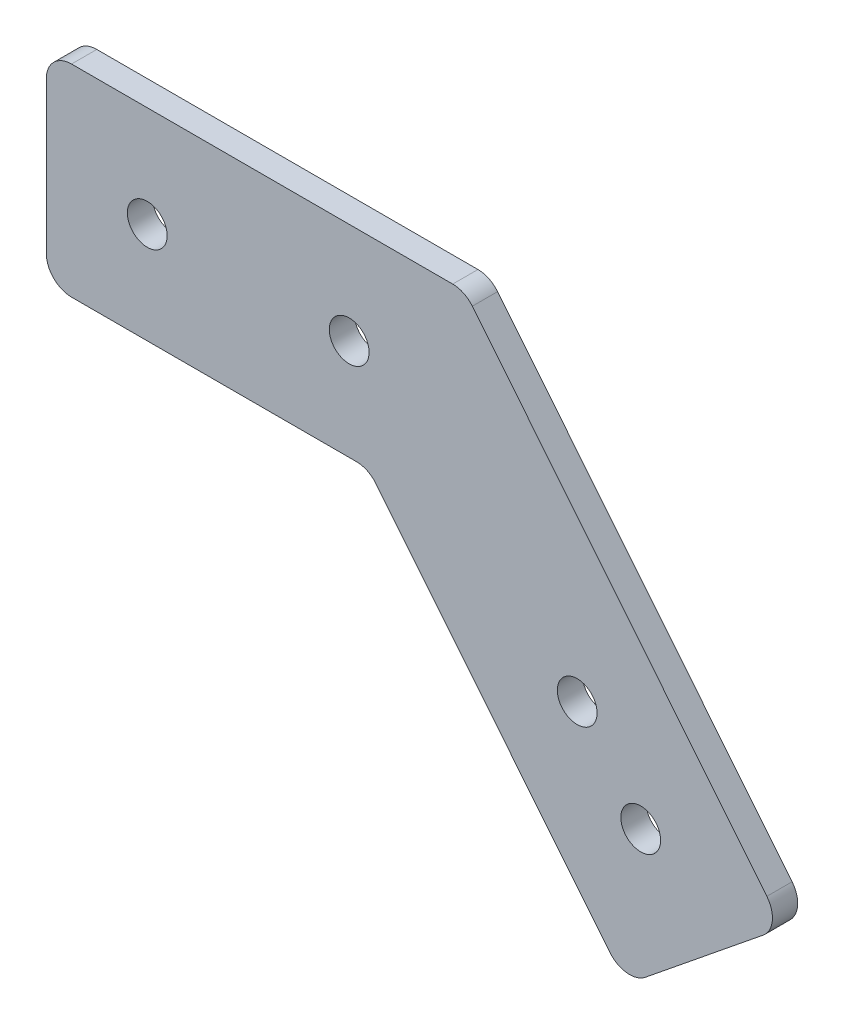
ISO-10303-21;
HEADER;
FILE_DESCRIPTION(('STEP AP214'),'2;1');
FILE_NAME('part.step','',(''),(''),'','','');
FILE_SCHEMA(('AUTOMOTIVE_DESIGN { 1 0 10303 214 1 1 1 1 }'));
ENDSEC;
DATA;
#1=APPLICATION_CONTEXT('core data for automotive mechanical design processes');
#2=APPLICATION_PROTOCOL_DEFINITION('international standard','automotive_design',2000,#1);
#3=PRODUCT_CONTEXT('',#1,'mechanical');
#4=PRODUCT('Part','Part','',(#3));
#5=PRODUCT_RELATED_PRODUCT_CATEGORY('part','',(#4));
#6=PRODUCT_DEFINITION_FORMATION('','',#4);
#7=PRODUCT_DEFINITION_CONTEXT('part definition',#1,'design');
#8=PRODUCT_DEFINITION('design','',#6,#7);
#9=PRODUCT_DEFINITION_SHAPE('','',#8);
#10=(LENGTH_UNIT() NAMED_UNIT(*) SI_UNIT(.MILLI.,.METRE.));
#11=(NAMED_UNIT(*) PLANE_ANGLE_UNIT() SI_UNIT($,.RADIAN.));
#12=(NAMED_UNIT(*) SI_UNIT($,.STERADIAN.) SOLID_ANGLE_UNIT());
#13=UNCERTAINTY_MEASURE_WITH_UNIT(LENGTH_MEASURE(1.E-05),#10,'distance_accuracy_value','');
#14=(GEOMETRIC_REPRESENTATION_CONTEXT(3) GLOBAL_UNCERTAINTY_ASSIGNED_CONTEXT((#13)) GLOBAL_UNIT_ASSIGNED_CONTEXT((#10,
#11,#12)) REPRESENTATION_CONTEXT('',''));
#15=CARTESIAN_POINT('',(0.,0.,0.));
#16=DIRECTION('',(0.,0.,1.));
#17=DIRECTION('',(1.,0.,0.));
#18=AXIS2_PLACEMENT_3D('',#15,#16,#17);
#19=CARTESIAN_POINT('',(0.,734.332068305698,3.175));
#20=DIRECTION('',(0.,1.,0.));
#21=DIRECTION('',(0.,0.,1.));
#22=AXIS2_PLACEMENT_3D('',#19,#20,#21);
#23=PLANE('',#22);
#24=DIRECTION('',(1.,0.,0.));
#25=VECTOR('',#24,1.);
#26=CARTESIAN_POINT('',(0.,734.332068305698,3.175));
#27=LINE('',#26,#25);
#28=CARTESIAN_POINT('',(3.175,734.332068305698,3.175));
#29=VERTEX_POINT('',#28);
#30=CARTESIAN_POINT('',(51.1213444829092,734.332068305698,3.175));
#31=VERTEX_POINT('',#30);
#32=EDGE_CURVE('E206',#29,#31,#27,.T.);
#33=ORIENTED_EDGE('',*,*,#32,.T.);
#34=DIRECTION('',(0.,0.,-1.));
#35=VECTOR('',#34,1.);
#36=CARTESIAN_POINT('',(51.1213444829092,734.332068305698,0.));
#37=LINE('',#36,#35);
#38=CARTESIAN_POINT('',(51.1213444829092,734.332068305698,0.));
#39=VERTEX_POINT('',#38);
#40=EDGE_CURVE('E136',#31,#39,#37,.T.);
#41=ORIENTED_EDGE('',*,*,#40,.T.);
#42=DIRECTION('',(1.,0.,0.));
#43=VECTOR('',#42,1.);
#44=CARTESIAN_POINT('',(0.,734.332068305698,0.));
#45=LINE('',#44,#43);
#46=CARTESIAN_POINT('',(3.175,734.332068305698,0.));
#47=VERTEX_POINT('',#46);
#48=EDGE_CURVE('E203',#47,#39,#45,.T.);
#49=ORIENTED_EDGE('',*,*,#48,.F.);
#50=DIRECTION('',(0.,0.,-1.));
#51=VECTOR('',#50,1.);
#52=CARTESIAN_POINT('',(3.175,734.332068305698,3.175));
#53=LINE('',#52,#51);
#54=EDGE_CURVE('E195',#47,#29,#53,.F.);
#55=ORIENTED_EDGE('',*,*,#54,.T.);
#56=EDGE_LOOP('',(#33,#41,#49,#55));
#57=FACE_BOUND('',#56,.T.);
#58=ADVANCED_FACE('F37',(#57),#23,.T.);
#59=CARTESIAN_POINT('',(1.32199812341468E-13,0.,3.175));
#60=DIRECTION('',(1.,0.,0.));
#61=DIRECTION('',(0.,1.,0.));
#62=AXIS2_PLACEMENT_3D('',#59,#60,#61);
#63=PLANE('',#62);
#64=DIRECTION('',(0.,-1.,0.));
#65=VECTOR('',#64,1.);
#66=CARTESIAN_POINT('',(1.32199812341468E-13,0.,0.));
#67=LINE('',#66,#65);
#68=CARTESIAN_POINT('',(0.,731.157068305698,0.));
#69=VERTEX_POINT('',#68);
#70=CARTESIAN_POINT('',(0.,712.107068305698,0.));
#71=VERTEX_POINT('',#70);
#72=EDGE_CURVE('E145',#69,#71,#67,.T.);
#73=ORIENTED_EDGE('',*,*,#72,.T.);
#74=DIRECTION('',(0.,0.,-1.));
#75=VECTOR('',#74,1.);
#76=CARTESIAN_POINT('',(0.,712.107068305698,3.175));
#77=LINE('',#76,#75);
#78=CARTESIAN_POINT('',(0.,712.107068305698,3.175));
#79=VERTEX_POINT('',#78);
#80=EDGE_CURVE('E171',#71,#79,#77,.F.);
#81=ORIENTED_EDGE('',*,*,#80,.T.);
#82=DIRECTION('',(0.,-1.,0.));
#83=VECTOR('',#82,1.);
#84=CARTESIAN_POINT('',(1.32199812341468E-13,0.,3.175));
#85=LINE('',#84,#83);
#86=CARTESIAN_POINT('',(0.,731.157068305698,3.175));
#87=VERTEX_POINT('',#86);
#88=EDGE_CURVE('E241',#87,#79,#85,.T.);
#89=ORIENTED_EDGE('',*,*,#88,.F.);
#90=DIRECTION('',(0.,0.,-1.));
#91=VECTOR('',#90,1.);
#92=CARTESIAN_POINT('',(0.,731.157068305698,0.));
#93=LINE('',#92,#91);
#94=EDGE_CURVE('E168',#87,#69,#93,.T.);
#95=ORIENTED_EDGE('',*,*,#94,.T.);
#96=EDGE_LOOP('',(#73,#81,#89,#95));
#97=FACE_BOUND('',#96,.T.);
#98=ADVANCED_FACE('F277',(#97),#63,.F.);
#99=CARTESIAN_POINT('',(0.,708.932068305698,3.175));
#100=DIRECTION('',(0.,-1.,0.));
#101=DIRECTION('',(0.,0.,-1.));
#102=AXIS2_PLACEMENT_3D('',#99,#100,#101);
#103=PLANE('',#102);
#104=DIRECTION('',(-1.,0.,0.));
#105=VECTOR('',#104,1.);
#106=CARTESIAN_POINT('',(0.,708.932068305698,3.175));
#107=LINE('',#106,#105);
#108=CARTESIAN_POINT('',(39.0039981510798,708.932068305698,3.175));
#109=VERTEX_POINT('',#108);
#110=CARTESIAN_POINT('',(3.175,708.932068305698,3.175));
#111=VERTEX_POINT('',#110);
#112=EDGE_CURVE('E244',#109,#111,#107,.T.);
#113=ORIENTED_EDGE('',*,*,#112,.T.);
#114=DIRECTION('',(0.,0.,-1.));
#115=VECTOR('',#114,1.);
#116=CARTESIAN_POINT('',(3.175,708.932068305698,0.));
#117=LINE('',#116,#115);
#118=CARTESIAN_POINT('',(3.175,708.932068305698,0.));
#119=VERTEX_POINT('',#118);
#120=EDGE_CURVE('E144',#111,#119,#117,.T.);
#121=ORIENTED_EDGE('',*,*,#120,.T.);
#122=DIRECTION('',(-1.,0.,0.));
#123=VECTOR('',#122,1.);
#124=CARTESIAN_POINT('',(0.,708.932068305698,0.));
#125=LINE('',#124,#123);
#126=CARTESIAN_POINT('',(39.0039981510798,708.932068305698,0.));
#127=VERTEX_POINT('',#126);
#128=EDGE_CURVE('E129',#127,#119,#125,.T.);
#129=ORIENTED_EDGE('',*,*,#128,.F.);
#130=DIRECTION('',(0.,0.,-1.));
#131=VECTOR('',#130,1.);
#132=CARTESIAN_POINT('',(39.0039981510798,708.932068305698,3.175));
#133=LINE('',#132,#131);
#134=EDGE_CURVE('E141',#127,#109,#133,.F.);
#135=ORIENTED_EDGE('',*,*,#134,.T.);
#136=EDGE_LOOP('',(#113,#121,#129,#135));
#137=FACE_BOUND('',#136,.T.);
#138=ADVANCED_FACE('F140',(#137),#103,.T.);
#139=CARTESIAN_POINT('',(371.176588177199,300.487426123172,3.175));
#140=DIRECTION('',(-0.777233462324333,-0.62921232111532,0.));
#141=DIRECTION('',(0.62921232111532,-0.777233462324334,0.));
#142=AXIS2_PLACEMENT_3D('',#139,#140,#141);
#143=PLANE('',#142);
#144=DIRECTION('',(-0.62921232111532,0.777233462324334,0.));
#145=VECTOR('',#144,1.);
#146=CARTESIAN_POINT('',(371.176588177199,300.487426123172,3.175));
#147=LINE('',#146,#145);
#148=CARTESIAN_POINT('',(70.8953718216004,671.409294031492,3.175));
#149=VERTEX_POINT('',#148);
#150=CARTESIAN_POINT('',(41.4717143939596,707.754817425239,3.175));
#151=VERTEX_POINT('',#150);
#152=EDGE_CURVE('E246',#149,#151,#147,.T.);
#153=ORIENTED_EDGE('',*,*,#152,.T.);
#154=DIRECTION('',(0.,0.,-1.));
#155=VECTOR('',#154,1.);
#156=CARTESIAN_POINT('',(41.4717143939596,707.754817425239,0.));
#157=LINE('',#156,#155);
#158=CARTESIAN_POINT('',(41.4717143939596,707.754817425239,0.));
#159=VERTEX_POINT('',#158);
#160=EDGE_CURVE('E184',#151,#159,#157,.T.);
#161=ORIENTED_EDGE('',*,*,#160,.T.);
#162=DIRECTION('',(-0.62921232111532,0.777233462324334,0.));
#163=VECTOR('',#162,1.);
#164=CARTESIAN_POINT('',(371.176588177199,300.487426123172,0.));
#165=LINE('',#164,#163);
#166=CARTESIAN_POINT('',(70.8953718216004,671.409294031492,0.));
#167=VERTEX_POINT('',#166);
#168=EDGE_CURVE('E131',#167,#159,#165,.T.);
#169=ORIENTED_EDGE('',*,*,#168,.F.);
#170=DIRECTION('',(0.,0.,-1.));
#171=VECTOR('',#170,1.);
#172=CARTESIAN_POINT('',(70.8953718216004,671.409294031492,3.175));
#173=LINE('',#172,#171);
#174=EDGE_CURVE('E182',#167,#149,#173,.F.);
#175=ORIENTED_EDGE('',*,*,#174,.T.);
#176=EDGE_LOOP('',(#153,#161,#169,#175));
#177=FACE_BOUND('',#176,.T.);
#178=ADVANCED_FACE('F287',(#177),#143,.T.);
#179=CARTESIAN_POINT('',(-298.283467236057,368.454151665441,3.175));
#180=DIRECTION('',(-0.629212321115319,0.777233462324334,0.));
#181=DIRECTION('',(-0.777233462324334,-0.629212321115319,0.));
#182=AXIS2_PLACEMENT_3D('',#179,#180,#181);
#183=PLANE('',#182);
#184=DIRECTION('',(0.777233462324334,0.629212321115319,0.));
#185=VECTOR('',#184,1.);
#186=CARTESIAN_POINT('',(-298.283467236057,368.454151665441,3.175));
#187=LINE('',#186,#185);
#188=CARTESIAN_POINT('',(75.3608371840215,670.939326908154,3.175));
#189=VERTEX_POINT('',#188);
#190=CARTESIAN_POINT('',(90.1671346412997,682.9258216254,3.175));
#191=VERTEX_POINT('',#190);
#192=EDGE_CURVE('E153',#189,#191,#187,.T.);
#193=ORIENTED_EDGE('',*,*,#192,.F.);
#194=DIRECTION('',(0.,0.,-1.));
#195=VECTOR('',#194,1.);
#196=CARTESIAN_POINT('',(75.3608371840213,670.939326908154,0.));
#197=LINE('',#196,#195);
#198=CARTESIAN_POINT('',(75.3608371840215,670.939326908154,0.));
#199=VERTEX_POINT('',#198);
#200=EDGE_CURVE('E188',#189,#199,#197,.T.);
#201=ORIENTED_EDGE('',*,*,#200,.T.);
#202=DIRECTION('',(0.777233462324334,0.629212321115319,0.));
#203=VECTOR('',#202,1.);
#204=CARTESIAN_POINT('',(-298.283467236057,368.454151665441,0.));
#205=LINE('',#204,#203);
#206=CARTESIAN_POINT('',(90.1671346412997,682.9258216254,0.));
#207=VERTEX_POINT('',#206);
#208=EDGE_CURVE('E220',#199,#207,#205,.T.);
#209=ORIENTED_EDGE('',*,*,#208,.T.);
#210=DIRECTION('',(0.,0.,-1.));
#211=VECTOR('',#210,1.);
#212=CARTESIAN_POINT('',(90.1671346412997,682.9258216254,3.175));
#213=LINE('',#212,#211);
#214=EDGE_CURVE('E186',#207,#191,#213,.F.);
#215=ORIENTED_EDGE('',*,*,#214,.T.);
#216=EDGE_LOOP('',(#193,#201,#209,#215));
#217=FACE_BOUND('',#216,.T.);
#218=ADVANCED_FACE('F273',(#217),#183,.F.);
#219=CARTESIAN_POINT('',(12.7,721.632068305698,3.175));
#220=DIRECTION('',(0.,0.,-1.));
#221=DIRECTION('',(-1.,0.,0.));
#222=AXIS2_PLACEMENT_3D('',#219,#220,#221);
#223=CYLINDRICAL_SURFACE('',#222,2.50189999999985);
#224=CARTESIAN_POINT('',(12.7,721.632068305698,3.175));
#225=DIRECTION('',(0.,0.,1.));
#226=DIRECTION('',(1.,0.,0.));
#227=AXIS2_PLACEMENT_3D('',#224,#225,#226);
#228=CIRCLE('',#227,2.50189999999985);
#229=CARTESIAN_POINT('',(15.2018999999998,721.632068305698,3.175));
#230=VERTEX_POINT('',#229);
#231=EDGE_CURVE('E237',#230,#230,#228,.T.);
#232=ORIENTED_EDGE('',*,*,#231,.T.);
#233=EDGE_LOOP('',(#232));
#234=FACE_BOUND('',#233,.T.);
#235=CARTESIAN_POINT('',(12.7,721.632068305698,0.));
#236=DIRECTION('',(0.,0.,1.));
#237=DIRECTION('',(1.,0.,0.));
#238=AXIS2_PLACEMENT_3D('',#235,#236,#237);
#239=CIRCLE('',#238,2.50189999999985);
#240=CARTESIAN_POINT('',(15.2018999999998,721.632068305698,0.));
#241=VERTEX_POINT('',#240);
#242=EDGE_CURVE('E211',#241,#241,#239,.T.);
#243=ORIENTED_EDGE('',*,*,#242,.F.);
#244=EDGE_LOOP('',(#243));
#245=FACE_BOUND('',#244,.T.);
#246=ADVANCED_FACE('F263',(#234,#245),#223,.F.);
#247=CARTESIAN_POINT('',(38.1,721.632068305698,3.175));
#248=DIRECTION('',(0.,0.,-1.));
#249=DIRECTION('',(-1.,0.,0.));
#250=AXIS2_PLACEMENT_3D('',#247,#248,#249);
#251=CYLINDRICAL_SURFACE('',#250,2.50189999999984);
#252=CARTESIAN_POINT('',(38.1,721.632068305698,3.175));
#253=DIRECTION('',(0.,0.,1.));
#254=DIRECTION('',(1.,0.,0.));
#255=AXIS2_PLACEMENT_3D('',#252,#253,#254);
#256=CIRCLE('',#255,2.50189999999984);
#257=CARTESIAN_POINT('',(40.6018999999998,721.632068305698,3.175));
#258=VERTEX_POINT('',#257);
#259=EDGE_CURVE('E232',#258,#258,#256,.T.);
#260=ORIENTED_EDGE('',*,*,#259,.T.);
#261=EDGE_LOOP('',(#260));
#262=FACE_BOUND('',#261,.T.);
#263=CARTESIAN_POINT('',(38.1,721.632068305698,0.));
#264=DIRECTION('',(0.,0.,1.));
#265=DIRECTION('',(1.,0.,0.));
#266=AXIS2_PLACEMENT_3D('',#263,#264,#265);
#267=CIRCLE('',#266,2.50189999999984);
#268=CARTESIAN_POINT('',(40.6018999999998,721.632068305698,0.));
#269=VERTEX_POINT('',#268);
#270=EDGE_CURVE('E216',#269,#269,#267,.T.);
#271=ORIENTED_EDGE('',*,*,#270,.F.);
#272=EDGE_LOOP('',(#271));
#273=FACE_BOUND('',#272,.T.);
#274=ADVANCED_FACE('F260',(#262,#273),#251,.F.);
#275=CARTESIAN_POINT('',(66.7819929563314,696.674304209815,3.175));
#276=DIRECTION('',(0.,0.,-1.));
#277=DIRECTION('',(-1.,0.,0.));
#278=AXIS2_PLACEMENT_3D('',#275,#276,#277);
#279=CYLINDRICAL_SURFACE('',#278,2.50189999999982);
#280=CARTESIAN_POINT('',(66.7819929563314,696.674304209815,3.175));
#281=DIRECTION('',(0.,0.,1.));
#282=DIRECTION('',(1.,0.,0.));
#283=AXIS2_PLACEMENT_3D('',#280,#281,#282);
#284=CIRCLE('',#283,2.50189999999982);
#285=CARTESIAN_POINT('',(69.2838929563312,696.674304209815,3.175));
#286=VERTEX_POINT('',#285);
#287=EDGE_CURVE('E227',#286,#286,#284,.T.);
#288=ORIENTED_EDGE('',*,*,#287,.T.);
#289=EDGE_LOOP('',(#288));
#290=FACE_BOUND('',#289,.T.);
#291=CARTESIAN_POINT('',(66.7819929563314,696.674304209815,0.));
#292=DIRECTION('',(0.,0.,1.));
#293=DIRECTION('',(1.,0.,0.));
#294=AXIS2_PLACEMENT_3D('',#291,#292,#293);
#295=CIRCLE('',#294,2.50189999999982);
#296=CARTESIAN_POINT('',(69.2838929563312,696.674304209815,0.));
#297=VERTEX_POINT('',#296);
#298=EDGE_CURVE('E253',#297,#297,#295,.T.);
#299=ORIENTED_EDGE('',*,*,#298,.F.);
#300=EDGE_LOOP('',(#299));
#301=FACE_BOUND('',#300,.T.);
#302=ADVANCED_FACE('F262',(#290,#301),#279,.F.);
#303=CARTESIAN_POINT('',(74.772989434496,686.803439238296,3.175));
#304=DIRECTION('',(0.,0.,-1.));
#305=DIRECTION('',(-1.,0.,0.));
#306=AXIS2_PLACEMENT_3D('',#303,#304,#305);
#307=CYLINDRICAL_SURFACE('',#306,2.50190000000043);
#308=CARTESIAN_POINT('',(74.772989434496,686.803439238296,3.175));
#309=DIRECTION('',(0.,0.,1.));
#310=DIRECTION('',(1.,0.,0.));
#311=AXIS2_PLACEMENT_3D('',#308,#309,#310);
#312=CIRCLE('',#311,2.50190000000043);
#313=CARTESIAN_POINT('',(77.2748894344964,686.803439238296,3.175));
#314=VERTEX_POINT('',#313);
#315=EDGE_CURVE('E225',#314,#314,#312,.T.);
#316=ORIENTED_EDGE('',*,*,#315,.T.);
#317=EDGE_LOOP('',(#316));
#318=FACE_BOUND('',#317,.T.);
#319=CARTESIAN_POINT('',(74.772989434496,686.803439238296,0.));
#320=DIRECTION('',(0.,0.,1.));
#321=DIRECTION('',(1.,0.,0.));
#322=AXIS2_PLACEMENT_3D('',#319,#320,#321);
#323=CIRCLE('',#322,2.50190000000043);
#324=CARTESIAN_POINT('',(77.2748894344964,686.803439238296,0.));
#325=VERTEX_POINT('',#324);
#326=EDGE_CURVE('E250',#325,#325,#323,.T.);
#327=ORIENTED_EDGE('',*,*,#326,.F.);
#328=EDGE_LOOP('',(#327));
#329=FACE_BOUND('',#328,.T.);
#330=ADVANCED_FACE('F270',(#318,#329),#307,.F.);
#331=CARTESIAN_POINT('',(390.918318120237,316.469419079498,3.175));
#332=DIRECTION('',(-0.777233462324337,-0.629212321115316,0.));
#333=DIRECTION('',(0.629212321115316,-0.777233462324337,0.));
#334=AXIS2_PLACEMENT_3D('',#331,#332,#333);
#335=PLANE('',#334);
#336=DIRECTION('',(-0.629212321115316,0.777233462324337,0.));
#337=VECTOR('',#336,1.);
#338=CARTESIAN_POINT('',(390.918318120237,316.469419079498,3.175));
#339=LINE('',#338,#337);
#340=CARTESIAN_POINT('',(90.6371017646382,687.391286987821,3.175));
#341=VERTEX_POINT('',#340);
#342=CARTESIAN_POINT('',(53.5890607257888,733.154817425239,3.175));
#343=VERTEX_POINT('',#342);
#344=EDGE_CURVE('E149',#341,#343,#339,.T.);
#345=ORIENTED_EDGE('',*,*,#344,.F.);
#346=DIRECTION('',(0.,0.,-1.));
#347=VECTOR('',#346,1.);
#348=CARTESIAN_POINT('',(90.6371017646382,687.391286987821,3.175));
#349=LINE('',#348,#347);
#350=CARTESIAN_POINT('',(90.6371017646382,687.391286987821,0.));
#351=VERTEX_POINT('',#350);
#352=EDGE_CURVE('E192',#341,#351,#349,.T.);
#353=ORIENTED_EDGE('',*,*,#352,.T.);
#354=DIRECTION('',(-0.629212321115316,0.777233462324337,0.));
#355=VECTOR('',#354,1.);
#356=CARTESIAN_POINT('',(390.918318120237,316.469419079498,0.));
#357=LINE('',#356,#355);
#358=CARTESIAN_POINT('',(53.5890607257888,733.154817425239,0.));
#359=VERTEX_POINT('',#358);
#360=EDGE_CURVE('E156',#351,#359,#357,.T.);
#361=ORIENTED_EDGE('',*,*,#360,.T.);
#362=DIRECTION('',(0.,0.,-1.));
#363=VECTOR('',#362,1.);
#364=CARTESIAN_POINT('',(53.5890607257889,733.154817425239,3.175));
#365=LINE('',#364,#363);
#366=EDGE_CURVE('E52',#359,#343,#365,.F.);
#367=ORIENTED_EDGE('',*,*,#366,.T.);
#368=EDGE_LOOP('',(#345,#353,#361,#367));
#369=FACE_BOUND('',#368,.T.);
#370=ADVANCED_FACE('F293',(#369),#335,.F.);
#371=CARTESIAN_POINT('',(0.,0.,3.175));
#372=DIRECTION('',(0.,0.,1.));
#373=DIRECTION('',(1.,0.,0.));
#374=AXIS2_PLACEMENT_3D('',#371,#372,#373);
#375=PLANE('',#374);
#376=ORIENTED_EDGE('',*,*,#315,.F.);
#377=EDGE_LOOP('',(#376));
#378=FACE_BOUND('',#377,.T.);
#379=ORIENTED_EDGE('',*,*,#287,.F.);
#380=EDGE_LOOP('',(#379));
#381=FACE_BOUND('',#380,.T.);
#382=ORIENTED_EDGE('',*,*,#259,.F.);
#383=EDGE_LOOP('',(#382));
#384=FACE_BOUND('',#383,.T.);
#385=ORIENTED_EDGE('',*,*,#231,.F.);
#386=EDGE_LOOP('',(#385));
#387=FACE_BOUND('',#386,.T.);
#388=ORIENTED_EDGE('',*,*,#88,.T.);
#389=CARTESIAN_POINT('',(3.175,712.107068305698,3.175));
#390=DIRECTION('',(0.,0.,1.));
#391=DIRECTION('',(1.,0.,0.));
#392=AXIS2_PLACEMENT_3D('',#389,#390,#391);
#393=CIRCLE('',#392,3.175);
#394=EDGE_CURVE('E180',#79,#111,#393,.T.);
#395=ORIENTED_EDGE('',*,*,#394,.T.);
#396=ORIENTED_EDGE('',*,*,#112,.F.);
#397=CARTESIAN_POINT('',(39.0039981510798,705.757068305698,3.175));
#398=DIRECTION('',(0.,0.,1.));
#399=DIRECTION('',(1.,0.,0.));
#400=AXIS2_PLACEMENT_3D('',#397,#398,#399);
#401=CIRCLE('',#400,3.175);
#402=EDGE_CURVE('E11',#109,#151,#401,.F.);
#403=ORIENTED_EDGE('',*,*,#402,.T.);
#404=ORIENTED_EDGE('',*,*,#152,.F.);
#405=CARTESIAN_POINT('',(73.3630880644802,673.407043151033,3.175));
#406=DIRECTION('',(0.,0.,1.));
#407=DIRECTION('',(1.,0.,0.));
#408=AXIS2_PLACEMENT_3D('',#405,#406,#407);
#409=CIRCLE('',#408,3.175);
#410=EDGE_CURVE('E178',#149,#189,#409,.T.);
#411=ORIENTED_EDGE('',*,*,#410,.T.);
#412=ORIENTED_EDGE('',*,*,#192,.T.);
#413=CARTESIAN_POINT('',(88.1693855217585,685.39353786828,3.175));
#414=DIRECTION('',(0.,0.,1.));
#415=DIRECTION('',(1.,0.,0.));
#416=AXIS2_PLACEMENT_3D('',#413,#414,#415);
#417=CIRCLE('',#416,3.175);
#418=EDGE_CURVE('E59',#191,#341,#417,.T.);
#419=ORIENTED_EDGE('',*,*,#418,.T.);
#420=ORIENTED_EDGE('',*,*,#344,.T.);
#421=CARTESIAN_POINT('',(51.1213444829092,731.157068305698,3.175));
#422=DIRECTION('',(0.,0.,1.));
#423=DIRECTION('',(1.,0.,0.));
#424=AXIS2_PLACEMENT_3D('',#421,#422,#423);
#425=CIRCLE('',#424,3.175);
#426=EDGE_CURVE('E175',#343,#31,#425,.T.);
#427=ORIENTED_EDGE('',*,*,#426,.T.);
#428=ORIENTED_EDGE('',*,*,#32,.F.);
#429=CARTESIAN_POINT('',(3.175,731.157068305698,3.175));
#430=DIRECTION('',(0.,0.,1.));
#431=DIRECTION('',(1.,0.,0.));
#432=AXIS2_PLACEMENT_3D('',#429,#430,#431);
#433=CIRCLE('',#432,3.175);
#434=EDGE_CURVE('E173',#29,#87,#433,.T.);
#435=ORIENTED_EDGE('',*,*,#434,.T.);
#436=EDGE_LOOP('',(#388,#395,#396,#403,#404,#411,#412,#419,#420,#427,#428,#435));
#437=FACE_BOUND('',#436,.T.);
#438=ADVANCED_FACE('F296',(#378,#381,#384,#387,#437),#375,.T.);
#439=CARTESIAN_POINT('',(0.,0.,0.));
#440=DIRECTION('',(0.,0.,1.));
#441=DIRECTION('',(1.,0.,0.));
#442=AXIS2_PLACEMENT_3D('',#439,#440,#441);
#443=PLANE('',#442);
#444=ORIENTED_EDGE('',*,*,#326,.T.);
#445=EDGE_LOOP('',(#444));
#446=FACE_BOUND('',#445,.T.);
#447=ORIENTED_EDGE('',*,*,#298,.T.);
#448=EDGE_LOOP('',(#447));
#449=FACE_BOUND('',#448,.T.);
#450=ORIENTED_EDGE('',*,*,#270,.T.);
#451=EDGE_LOOP('',(#450));
#452=FACE_BOUND('',#451,.T.);
#453=ORIENTED_EDGE('',*,*,#242,.T.);
#454=EDGE_LOOP('',(#453));
#455=FACE_BOUND('',#454,.T.);
#456=ORIENTED_EDGE('',*,*,#128,.T.);
#457=CARTESIAN_POINT('',(3.175,712.107068305698,0.));
#458=DIRECTION('',(0.,0.,1.));
#459=DIRECTION('',(1.,0.,0.));
#460=AXIS2_PLACEMENT_3D('',#457,#458,#459);
#461=CIRCLE('',#460,3.175);
#462=EDGE_CURVE('E166',#119,#71,#461,.F.);
#463=ORIENTED_EDGE('',*,*,#462,.T.);
#464=ORIENTED_EDGE('',*,*,#72,.F.);
#465=CARTESIAN_POINT('',(3.175,731.157068305698,0.));
#466=DIRECTION('',(0.,0.,1.));
#467=DIRECTION('',(1.,0.,0.));
#468=AXIS2_PLACEMENT_3D('',#465,#466,#467);
#469=CIRCLE('',#468,3.175);
#470=EDGE_CURVE('E151',#69,#47,#469,.F.);
#471=ORIENTED_EDGE('',*,*,#470,.T.);
#472=ORIENTED_EDGE('',*,*,#48,.T.);
#473=CARTESIAN_POINT('',(51.1213444829092,731.157068305698,0.));
#474=DIRECTION('',(0.,0.,1.));
#475=DIRECTION('',(1.,0.,0.));
#476=AXIS2_PLACEMENT_3D('',#473,#474,#475);
#477=CIRCLE('',#476,3.175);
#478=EDGE_CURVE('E160',#39,#359,#477,.F.);
#479=ORIENTED_EDGE('',*,*,#478,.T.);
#480=ORIENTED_EDGE('',*,*,#360,.F.);
#481=CARTESIAN_POINT('',(88.1693855217585,685.39353786828,0.));
#482=DIRECTION('',(0.,0.,1.));
#483=DIRECTION('',(1.,0.,0.));
#484=AXIS2_PLACEMENT_3D('',#481,#482,#483);
#485=CIRCLE('',#484,3.175);
#486=EDGE_CURVE('E162',#351,#207,#485,.F.);
#487=ORIENTED_EDGE('',*,*,#486,.T.);
#488=ORIENTED_EDGE('',*,*,#208,.F.);
#489=CARTESIAN_POINT('',(73.3630880644802,673.407043151033,0.));
#490=DIRECTION('',(0.,0.,1.));
#491=DIRECTION('',(1.,0.,0.));
#492=AXIS2_PLACEMENT_3D('',#489,#490,#491);
#493=CIRCLE('',#492,3.175);
#494=EDGE_CURVE('E164',#199,#167,#493,.F.);
#495=ORIENTED_EDGE('',*,*,#494,.T.);
#496=ORIENTED_EDGE('',*,*,#168,.T.);
#497=CARTESIAN_POINT('',(39.0039981510798,705.757068305698,0.));
#498=DIRECTION('',(0.,0.,1.));
#499=DIRECTION('',(1.,0.,0.));
#500=AXIS2_PLACEMENT_3D('',#497,#498,#499);
#501=CIRCLE('',#500,3.175);
#502=EDGE_CURVE('E45',#159,#127,#501,.T.);
#503=ORIENTED_EDGE('',*,*,#502,.T.);
#504=EDGE_LOOP('',(#456,#463,#464,#471,#472,#479,#480,#487,#488,#495,#496,#503));
#505=FACE_BOUND('',#504,.T.);
#506=ADVANCED_FACE('F128',(#446,#449,#452,#455,#505),#443,.F.);
#507=CARTESIAN_POINT('',(3.175,712.107068305698,3.175));
#508=DIRECTION('',(0.,0.,1.));
#509=DIRECTION('',(1.,0.,0.));
#510=AXIS2_PLACEMENT_3D('',#507,#508,#509);
#511=CYLINDRICAL_SURFACE('',#510,3.175);
#512=ORIENTED_EDGE('',*,*,#394,.F.);
#513=ORIENTED_EDGE('',*,*,#80,.F.);
#514=ORIENTED_EDGE('',*,*,#462,.F.);
#515=ORIENTED_EDGE('',*,*,#120,.F.);
#516=EDGE_LOOP('',(#512,#513,#514,#515));
#517=FACE_BOUND('',#516,.T.);
#518=ADVANCED_FACE('F299',(#517),#511,.T.);
#519=CARTESIAN_POINT('',(39.0039981510798,705.757068305698,3.175));
#520=DIRECTION('',(0.,0.,1.));
#521=DIRECTION('',(1.,0.,0.));
#522=AXIS2_PLACEMENT_3D('',#519,#520,#521);
#523=CYLINDRICAL_SURFACE('',#522,3.175);
#524=ORIENTED_EDGE('',*,*,#402,.F.);
#525=ORIENTED_EDGE('',*,*,#134,.F.);
#526=ORIENTED_EDGE('',*,*,#502,.F.);
#527=ORIENTED_EDGE('',*,*,#160,.F.);
#528=EDGE_LOOP('',(#524,#525,#526,#527));
#529=FACE_BOUND('',#528,.T.);
#530=ADVANCED_FACE('F148',(#529),#523,.F.);
#531=CARTESIAN_POINT('',(73.3630880644802,673.407043151033,3.175));
#532=DIRECTION('',(0.,0.,1.));
#533=DIRECTION('',(1.,0.,0.));
#534=AXIS2_PLACEMENT_3D('',#531,#532,#533);
#535=CYLINDRICAL_SURFACE('',#534,3.175);
#536=ORIENTED_EDGE('',*,*,#410,.F.);
#537=ORIENTED_EDGE('',*,*,#174,.F.);
#538=ORIENTED_EDGE('',*,*,#494,.F.);
#539=ORIENTED_EDGE('',*,*,#200,.F.);
#540=EDGE_LOOP('',(#536,#537,#538,#539));
#541=FACE_BOUND('',#540,.T.);
#542=ADVANCED_FACE('F325',(#541),#535,.T.);
#543=CARTESIAN_POINT('',(88.1693855217585,685.39353786828,3.175));
#544=DIRECTION('',(0.,0.,-1.));
#545=DIRECTION('',(-1.,0.,0.));
#546=AXIS2_PLACEMENT_3D('',#543,#544,#545);
#547=CYLINDRICAL_SURFACE('',#546,3.175);
#548=ORIENTED_EDGE('',*,*,#418,.F.);
#549=ORIENTED_EDGE('',*,*,#214,.F.);
#550=ORIENTED_EDGE('',*,*,#486,.F.);
#551=ORIENTED_EDGE('',*,*,#352,.F.);
#552=EDGE_LOOP('',(#548,#549,#550,#551));
#553=FACE_BOUND('',#552,.T.);
#554=ADVANCED_FACE('F320',(#553),#547,.T.);
#555=CARTESIAN_POINT('',(51.1213444829092,731.157068305698,3.175));
#556=DIRECTION('',(0.,0.,1.));
#557=DIRECTION('',(1.,0.,0.));
#558=AXIS2_PLACEMENT_3D('',#555,#556,#557);
#559=CYLINDRICAL_SURFACE('',#558,3.175);
#560=ORIENTED_EDGE('',*,*,#426,.F.);
#561=ORIENTED_EDGE('',*,*,#366,.F.);
#562=ORIENTED_EDGE('',*,*,#478,.F.);
#563=ORIENTED_EDGE('',*,*,#40,.F.);
#564=EDGE_LOOP('',(#560,#561,#562,#563));
#565=FACE_BOUND('',#564,.T.);
#566=ADVANCED_FACE('F318',(#565),#559,.T.);
#567=CARTESIAN_POINT('',(3.175,731.157068305698,3.175));
#568=DIRECTION('',(0.,0.,1.));
#569=DIRECTION('',(1.,0.,0.));
#570=AXIS2_PLACEMENT_3D('',#567,#568,#569);
#571=CYLINDRICAL_SURFACE('',#570,3.175);
#572=ORIENTED_EDGE('',*,*,#434,.F.);
#573=ORIENTED_EDGE('',*,*,#54,.F.);
#574=ORIENTED_EDGE('',*,*,#470,.F.);
#575=ORIENTED_EDGE('',*,*,#94,.F.);
#576=EDGE_LOOP('',(#572,#573,#574,#575));
#577=FACE_BOUND('',#576,.T.);
#578=ADVANCED_FACE('F39',(#577),#571,.T.);
#579=CLOSED_SHELL('',(#58,#98,#138,#178,#218,#246,#274,#302,#330,#370,#438,#506,#518,#530,#542,
#554,#566,#578));
#580=MANIFOLD_SOLID_BREP('B2',#579);
#581=ADVANCED_BREP_SHAPE_REPRESENTATION('',(#18,#580),#14);
#582=SHAPE_DEFINITION_REPRESENTATION(#9,#581);
ENDSEC;
END-ISO-10303-21;
